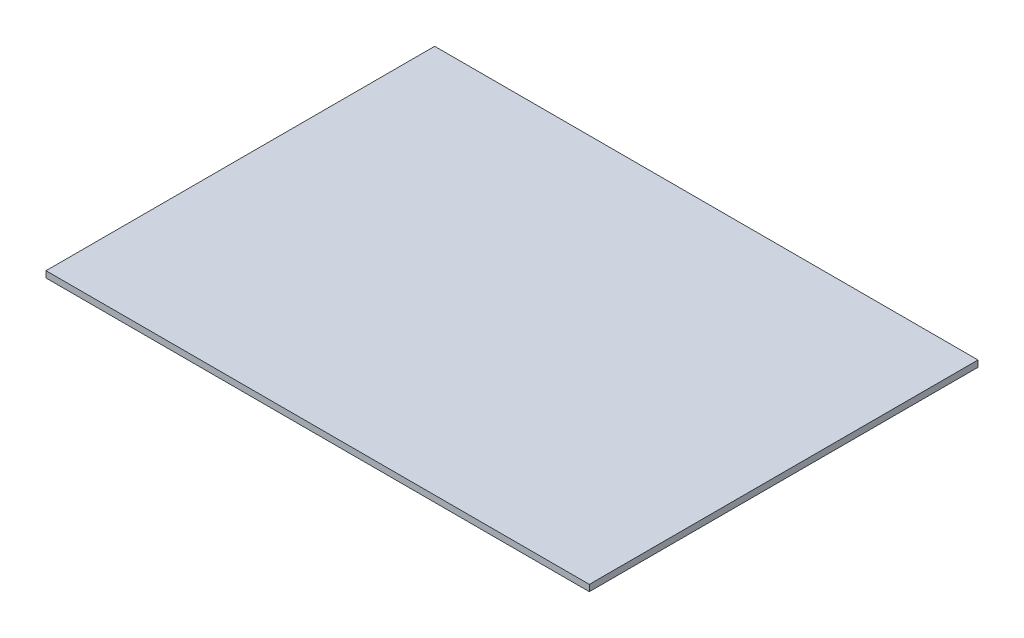
ISO-10303-21;
HEADER;
FILE_DESCRIPTION(('STEP AP214'),'2;1');
FILE_NAME('part.step','',(''),(''),'','','');
FILE_SCHEMA(('AUTOMOTIVE_DESIGN { 1 0 10303 214 1 1 1 1 }'));
ENDSEC;
DATA;
#1=APPLICATION_CONTEXT('core data for automotive mechanical design processes');
#2=APPLICATION_PROTOCOL_DEFINITION('international standard','automotive_design',2000,#1);
#3=PRODUCT_CONTEXT('',#1,'mechanical');
#4=PRODUCT('Part','Part','',(#3));
#5=PRODUCT_RELATED_PRODUCT_CATEGORY('part','',(#4));
#6=PRODUCT_DEFINITION_FORMATION('','',#4);
#7=PRODUCT_DEFINITION_CONTEXT('part definition',#1,'design');
#8=PRODUCT_DEFINITION('design','',#6,#7);
#9=PRODUCT_DEFINITION_SHAPE('','',#8);
#10=(LENGTH_UNIT() NAMED_UNIT(*) SI_UNIT(.MILLI.,.METRE.));
#11=(NAMED_UNIT(*) PLANE_ANGLE_UNIT() SI_UNIT($,.RADIAN.));
#12=(NAMED_UNIT(*) SI_UNIT($,.STERADIAN.) SOLID_ANGLE_UNIT());
#13=UNCERTAINTY_MEASURE_WITH_UNIT(LENGTH_MEASURE(1.E-05),#10,'distance_accuracy_value','');
#14=(GEOMETRIC_REPRESENTATION_CONTEXT(3) GLOBAL_UNCERTAINTY_ASSIGNED_CONTEXT((#13)) GLOBAL_UNIT_ASSIGNED_CONTEXT((#10,
#11,#12)) REPRESENTATION_CONTEXT('',''));
#15=CARTESIAN_POINT('',(0.,0.,0.));
#16=DIRECTION('',(0.,0.,1.));
#17=DIRECTION('',(1.,0.,0.));
#18=AXIS2_PLACEMENT_3D('',#15,#16,#17);
#19=CARTESIAN_POINT('',(0.,3.048,0.));
#20=DIRECTION('',(1.,0.,0.));
#21=DIRECTION('',(0.,0.,-1.));
#22=AXIS2_PLACEMENT_3D('',#19,#20,#21);
#23=PLANE('',#22);
#24=DIRECTION('',(0.,0.,1.));
#25=VECTOR('',#24,1.);
#26=CARTESIAN_POINT('',(0.,0.,0.));
#27=LINE('',#26,#25);
#28=CARTESIAN_POINT('',(0.,0.,-186.));
#29=VERTEX_POINT('',#28);
#30=CARTESIAN_POINT('',(0.,0.,0.));
#31=VERTEX_POINT('',#30);
#32=EDGE_CURVE('E97',#29,#31,#27,.T.);
#33=ORIENTED_EDGE('',*,*,#32,.T.);
#34=DIRECTION('',(0.,-1.,0.));
#35=VECTOR('',#34,1.);
#36=CARTESIAN_POINT('',(0.,3.048,0.));
#37=LINE('',#36,#35);
#38=CARTESIAN_POINT('',(0.,3.048,0.));
#39=VERTEX_POINT('',#38);
#40=EDGE_CURVE('E11',#39,#31,#37,.T.);
#41=ORIENTED_EDGE('',*,*,#40,.F.);
#42=DIRECTION('',(0.,0.,1.));
#43=VECTOR('',#42,1.);
#44=CARTESIAN_POINT('',(0.,3.048,0.));
#45=LINE('',#44,#43);
#46=CARTESIAN_POINT('',(0.,3.048,-186.));
#47=VERTEX_POINT('',#46);
#48=EDGE_CURVE('E85',#47,#39,#45,.T.);
#49=ORIENTED_EDGE('',*,*,#48,.F.);
#50=DIRECTION('',(0.,-1.,0.));
#51=VECTOR('',#50,1.);
#52=CARTESIAN_POINT('',(0.,3.048,-186.));
#53=LINE('',#52,#51);
#54=EDGE_CURVE('E93',#47,#29,#53,.T.);
#55=ORIENTED_EDGE('',*,*,#54,.T.);
#56=EDGE_LOOP('',(#33,#41,#49,#55));
#57=FACE_BOUND('',#56,.T.);
#58=ADVANCED_FACE('F34',(#57),#23,.F.);
#59=CARTESIAN_POINT('',(0.,3.048,0.));
#60=DIRECTION('',(0.,0.,-1.));
#61=DIRECTION('',(-1.,0.,0.));
#62=AXIS2_PLACEMENT_3D('',#59,#60,#61);
#63=PLANE('',#62);
#64=DIRECTION('',(1.,0.,0.));
#65=VECTOR('',#64,1.);
#66=CARTESIAN_POINT('',(0.,0.,0.));
#67=LINE('',#66,#65);
#68=CARTESIAN_POINT('',(260.,0.,0.));
#69=VERTEX_POINT('',#68);
#70=EDGE_CURVE('E89',#31,#69,#67,.T.);
#71=ORIENTED_EDGE('',*,*,#70,.T.);
#72=DIRECTION('',(0.,-1.,0.));
#73=VECTOR('',#72,1.);
#74=CARTESIAN_POINT('',(260.,3.048,0.));
#75=LINE('',#74,#73);
#76=CARTESIAN_POINT('',(260.,3.048,0.));
#77=VERTEX_POINT('',#76);
#78=EDGE_CURVE('E42',#77,#69,#75,.T.);
#79=ORIENTED_EDGE('',*,*,#78,.F.);
#80=DIRECTION('',(1.,0.,0.));
#81=VECTOR('',#80,1.);
#82=CARTESIAN_POINT('',(0.,3.048,0.));
#83=LINE('',#82,#81);
#84=EDGE_CURVE('E80',#39,#77,#83,.T.);
#85=ORIENTED_EDGE('',*,*,#84,.F.);
#86=ORIENTED_EDGE('',*,*,#40,.T.);
#87=EDGE_LOOP('',(#71,#79,#85,#86));
#88=FACE_BOUND('',#87,.T.);
#89=ADVANCED_FACE('F88',(#88),#63,.F.);
#90=CARTESIAN_POINT('',(260.,3.048,0.));
#91=DIRECTION('',(-1.,0.,0.));
#92=DIRECTION('',(0.,0.,1.));
#93=AXIS2_PLACEMENT_3D('',#90,#91,#92);
#94=PLANE('',#93);
#95=DIRECTION('',(0.,0.,-1.));
#96=VECTOR('',#95,1.);
#97=CARTESIAN_POINT('',(260.,0.,0.));
#98=LINE('',#97,#96);
#99=CARTESIAN_POINT('',(260.,0.,-186.));
#100=VERTEX_POINT('',#99);
#101=EDGE_CURVE('E67',#69,#100,#98,.T.);
#102=ORIENTED_EDGE('',*,*,#101,.T.);
#103=DIRECTION('',(0.,-1.,0.));
#104=VECTOR('',#103,1.);
#105=CARTESIAN_POINT('',(260.,3.048,-186.));
#106=LINE('',#105,#104);
#107=CARTESIAN_POINT('',(260.,3.048,-186.));
#108=VERTEX_POINT('',#107);
#109=EDGE_CURVE('E90',#108,#100,#106,.T.);
#110=ORIENTED_EDGE('',*,*,#109,.F.);
#111=DIRECTION('',(0.,0.,-1.));
#112=VECTOR('',#111,1.);
#113=CARTESIAN_POINT('',(260.,3.048,0.));
#114=LINE('',#113,#112);
#115=EDGE_CURVE('E83',#77,#108,#114,.T.);
#116=ORIENTED_EDGE('',*,*,#115,.F.);
#117=ORIENTED_EDGE('',*,*,#78,.T.);
#118=EDGE_LOOP('',(#102,#110,#116,#117));
#119=FACE_BOUND('',#118,.T.);
#120=ADVANCED_FACE('F91',(#119),#94,.F.);
#121=CARTESIAN_POINT('',(0.,3.048,-186.));
#122=DIRECTION('',(0.,0.,1.));
#123=DIRECTION('',(1.,0.,0.));
#124=AXIS2_PLACEMENT_3D('',#121,#122,#123);
#125=PLANE('',#124);
#126=DIRECTION('',(-1.,0.,0.));
#127=VECTOR('',#126,1.);
#128=CARTESIAN_POINT('',(0.,0.,-186.));
#129=LINE('',#128,#127);
#130=EDGE_CURVE('E73',#100,#29,#129,.T.);
#131=ORIENTED_EDGE('',*,*,#130,.T.);
#132=ORIENTED_EDGE('',*,*,#54,.F.);
#133=DIRECTION('',(-1.,0.,0.));
#134=VECTOR('',#133,1.);
#135=CARTESIAN_POINT('',(0.,3.048,-186.));
#136=LINE('',#135,#134);
#137=EDGE_CURVE('E50',#108,#47,#136,.T.);
#138=ORIENTED_EDGE('',*,*,#137,.F.);
#139=ORIENTED_EDGE('',*,*,#109,.T.);
#140=EDGE_LOOP('',(#131,#132,#138,#139));
#141=FACE_BOUND('',#140,.T.);
#142=ADVANCED_FACE('F104',(#141),#125,.F.);
#143=CARTESIAN_POINT('',(0.,3.048,0.));
#144=DIRECTION('',(0.,-1.,0.));
#145=DIRECTION('',(0.,0.,-1.));
#146=AXIS2_PLACEMENT_3D('',#143,#144,#145);
#147=PLANE('',#146);
#148=ORIENTED_EDGE('',*,*,#48,.T.);
#149=ORIENTED_EDGE('',*,*,#84,.T.);
#150=ORIENTED_EDGE('',*,*,#115,.T.);
#151=ORIENTED_EDGE('',*,*,#137,.T.);
#152=EDGE_LOOP('',(#148,#149,#150,#151));
#153=FACE_BOUND('',#152,.T.);
#154=ADVANCED_FACE('F81',(#153),#147,.F.);
#155=CARTESIAN_POINT('',(0.,0.,0.));
#156=DIRECTION('',(0.,-1.,0.));
#157=DIRECTION('',(0.,0.,-1.));
#158=AXIS2_PLACEMENT_3D('',#155,#156,#157);
#159=PLANE('',#158);
#160=ORIENTED_EDGE('',*,*,#32,.F.);
#161=ORIENTED_EDGE('',*,*,#130,.F.);
#162=ORIENTED_EDGE('',*,*,#101,.F.);
#163=ORIENTED_EDGE('',*,*,#70,.F.);
#164=EDGE_LOOP('',(#160,#161,#162,#163));
#165=FACE_BOUND('',#164,.T.);
#166=ADVANCED_FACE('F107',(#165),#159,.T.);
#167=CLOSED_SHELL('',(#58,#89,#120,#142,#154,#166));
#168=MANIFOLD_SOLID_BREP('B2',#167);
#169=ADVANCED_BREP_SHAPE_REPRESENTATION('',(#18,#168),#14);
#170=SHAPE_DEFINITION_REPRESENTATION(#9,#169);
ENDSEC;
END-ISO-10303-21;
